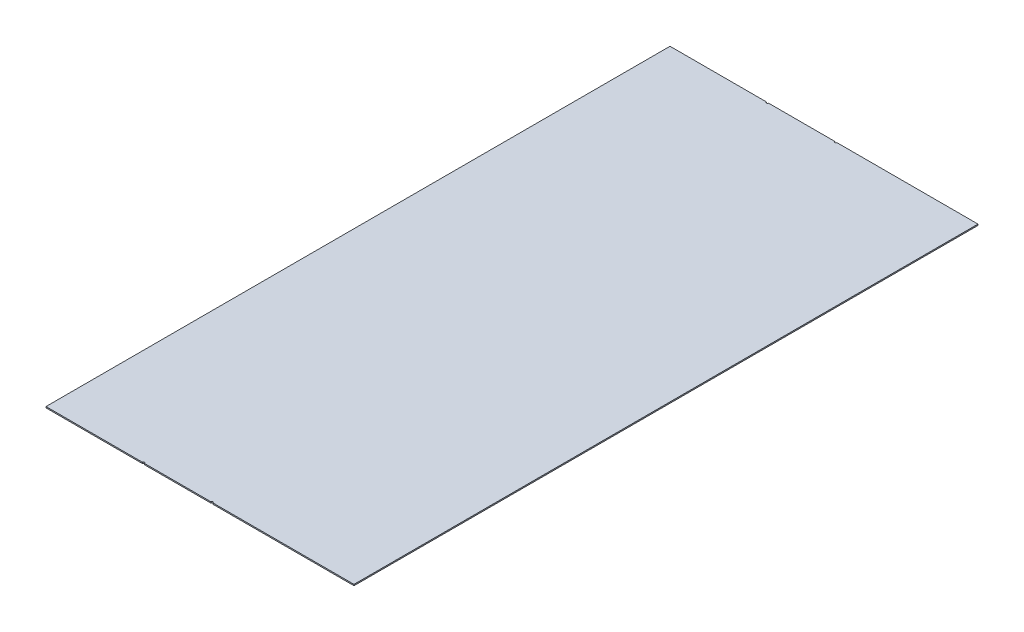
ISO-10303-21;
HEADER;
FILE_DESCRIPTION(('STEP AP214'),'2;1');
FILE_NAME('part.step','',(''),(''),'','','');
FILE_SCHEMA(('AUTOMOTIVE_DESIGN { 1 0 10303 214 1 1 1 1 }'));
ENDSEC;
DATA;
#1=APPLICATION_CONTEXT('core data for automotive mechanical design processes');
#2=APPLICATION_PROTOCOL_DEFINITION('international standard','automotive_design',2000,#1);
#3=PRODUCT_CONTEXT('',#1,'mechanical');
#4=PRODUCT('Part','Part','',(#3));
#5=PRODUCT_RELATED_PRODUCT_CATEGORY('part','',(#4));
#6=PRODUCT_DEFINITION_FORMATION('','',#4);
#7=PRODUCT_DEFINITION_CONTEXT('part definition',#1,'design');
#8=PRODUCT_DEFINITION('design','',#6,#7);
#9=PRODUCT_DEFINITION_SHAPE('','',#8);
#10=(LENGTH_UNIT() NAMED_UNIT(*) SI_UNIT(.MILLI.,.METRE.));
#11=(NAMED_UNIT(*) PLANE_ANGLE_UNIT() SI_UNIT($,.RADIAN.));
#12=(NAMED_UNIT(*) SI_UNIT($,.STERADIAN.) SOLID_ANGLE_UNIT());
#13=UNCERTAINTY_MEASURE_WITH_UNIT(LENGTH_MEASURE(1.E-05),#10,'distance_accuracy_value','');
#14=(GEOMETRIC_REPRESENTATION_CONTEXT(3) GLOBAL_UNCERTAINTY_ASSIGNED_CONTEXT((#13)) GLOBAL_UNIT_ASSIGNED_CONTEXT((#10,
#11,#12)) REPRESENTATION_CONTEXT('',''));
#15=CARTESIAN_POINT('',(0.,0.,0.));
#16=DIRECTION('',(0.,0.,1.));
#17=DIRECTION('',(1.,0.,0.));
#18=AXIS2_PLACEMENT_3D('',#15,#16,#17);
#19=CARTESIAN_POINT('',(-78.9587528010179,-593.535533905934,-2550.));
#20=DIRECTION('',(0.,0.,-1.));
#21=DIRECTION('',(-0.707106781186542,-0.707106781186553,0.));
#22=AXIS2_PLACEMENT_3D('',#19,#20,#21);
#23=PLANE('',#22);
#24=DIRECTION('',(0.,1.,0.));
#25=VECTOR('',#24,1.);
#26=CARTESIAN_POINT('',(-81.9266755409145,-600.000000000013,-2550.));
#27=LINE('',#26,#25);
#28=CARTESIAN_POINT('',(-81.9266755409145,-600.000000000013,-2550.));
#29=VERTEX_POINT('',#28);
#30=CARTESIAN_POINT('',(-81.9266755409145,-595.,-2550.));
#31=VERTEX_POINT('',#30);
#32=EDGE_CURVE('E66',#29,#31,#27,.T.);
#33=ORIENTED_EDGE('',*,*,#32,.F.);
#34=DIRECTION('',(1.,0.,0.));
#35=VECTOR('',#34,1.);
#36=CARTESIAN_POINT('',(-79.565354518816,-600.000000000002,-2550.));
#37=LINE('',#36,#35);
#38=CARTESIAN_POINT('',(-476.287996563013,-600.000000000013,-2550.));
#39=VERTEX_POINT('',#38);
#40=EDGE_CURVE('E155',#39,#29,#37,.T.);
#41=ORIENTED_EDGE('',*,*,#40,.F.);
#42=DIRECTION('',(0.,1.,0.));
#43=VECTOR('',#42,1.);
#44=CARTESIAN_POINT('',(-476.287996563013,-600.000000000013,-2550.));
#45=LINE('',#44,#43);
#46=CARTESIAN_POINT('',(-476.287996563013,-595.000000000013,-2550.));
#47=VERTEX_POINT('',#46);
#48=EDGE_CURVE('E190',#39,#47,#45,.T.);
#49=ORIENTED_EDGE('',*,*,#48,.T.);
#50=DIRECTION('',(1.,0.,0.));
#51=VECTOR('',#50,1.);
#52=CARTESIAN_POINT('',(-79.565354518816,-595.000000000001,-2550.));
#53=LINE('',#52,#51);
#54=EDGE_CURVE('E153',#47,#31,#53,.T.);
#55=ORIENTED_EDGE('',*,*,#54,.T.);
#56=EDGE_LOOP('',(#33,#41,#49,#55));
#57=FACE_BOUND('',#56,.T.);
#58=ADVANCED_FACE('F43',(#57),#23,.T.);
#59=DIRECTION('',(0.,1.,0.));
#60=VECTOR('',#59,1.);
#61=CARTESIAN_POINT('',(-73.9266755409145,-600.000000000013,-2550.));
#62=LINE('',#61,#60);
#63=CARTESIAN_POINT('',(-73.9266755409145,-595.,-2550.));
#64=VERTEX_POINT('',#63);
#65=CARTESIAN_POINT('',(-73.9266755409145,-600.000000000013,-2550.));
#66=VERTEX_POINT('',#65);
#67=EDGE_CURVE('E219',#64,#66,#62,.F.);
#68=ORIENTED_EDGE('',*,*,#67,.F.);
#69=CARTESIAN_POINT('',(197.638678977901,-595.,-2550.));
#70=VERTEX_POINT('',#69);
#71=EDGE_CURVE('E157',#64,#70,#53,.T.);
#72=ORIENTED_EDGE('',*,*,#71,.T.);
#73=DIRECTION('',(0.,1.,0.));
#74=VECTOR('',#73,1.);
#75=CARTESIAN_POINT('',(197.638678977901,-600.000000000013,-2550.));
#76=LINE('',#75,#74);
#77=CARTESIAN_POINT('',(197.638678977901,-600.000000000013,-2550.));
#78=VERTEX_POINT('',#77);
#79=EDGE_CURVE('E58',#78,#70,#76,.T.);
#80=ORIENTED_EDGE('',*,*,#79,.F.);
#81=EDGE_CURVE('E146',#66,#78,#37,.T.);
#82=ORIENTED_EDGE('',*,*,#81,.F.);
#83=EDGE_LOOP('',(#68,#72,#80,#82));
#84=FACE_BOUND('',#83,.T.);
#85=ADVANCED_FACE('F255',(#84),#23,.T.);
#86=CARTESIAN_POINT('',(202.670756238004,-593.535533905933,0.));
#87=DIRECTION('',(0.,0.,1.));
#88=DIRECTION('',(0.707106781186542,0.707106781186553,0.));
#89=AXIS2_PLACEMENT_3D('',#86,#87,#88);
#90=PLANE('',#89);
#91=DIRECTION('',(0.,1.,0.));
#92=VECTOR('',#91,1.);
#93=CARTESIAN_POINT('',(205.638678977901,-600.000000000013,0.));
#94=LINE('',#93,#92);
#95=CARTESIAN_POINT('',(205.638678977901,-600.000000000013,0.));
#96=VERTEX_POINT('',#95);
#97=CARTESIAN_POINT('',(205.638678977901,-595.,0.));
#98=VERTEX_POINT('',#97);
#99=EDGE_CURVE('E186',#96,#98,#94,.T.);
#100=ORIENTED_EDGE('',*,*,#99,.F.);
#101=DIRECTION('',(1.,0.,0.));
#102=VECTOR('',#101,1.);
#103=CARTESIAN_POINT('',(-79.565354518816,-600.000000000002,0.));
#104=LINE('',#103,#102);
#105=CARTESIAN_POINT('',(782.34,-600.,0.));
#106=VERTEX_POINT('',#105);
#107=EDGE_CURVE('E196',#96,#106,#104,.T.);
#108=ORIENTED_EDGE('',*,*,#107,.T.);
#109=DIRECTION('',(0.,-1.,0.));
#110=VECTOR('',#109,1.);
#111=CARTESIAN_POINT('',(782.34,-595.,0.));
#112=LINE('',#111,#110);
#113=CARTESIAN_POINT('',(782.34,-595.,0.));
#114=VERTEX_POINT('',#113);
#115=EDGE_CURVE('E189',#114,#106,#112,.T.);
#116=ORIENTED_EDGE('',*,*,#115,.F.);
#117=DIRECTION('',(1.,0.,0.));
#118=VECTOR('',#117,1.);
#119=CARTESIAN_POINT('',(-79.565354518816,-595.000000000001,0.));
#120=LINE('',#119,#118);
#121=EDGE_CURVE('E176',#98,#114,#120,.T.);
#122=ORIENTED_EDGE('',*,*,#121,.F.);
#123=EDGE_LOOP('',(#100,#108,#116,#122));
#124=FACE_BOUND('',#123,.T.);
#125=ADVANCED_FACE('F185',(#124),#90,.T.);
#126=DIRECTION('',(0.,1.,0.));
#127=VECTOR('',#126,1.);
#128=CARTESIAN_POINT('',(197.638678977901,-600.000000000013,0.));
#129=LINE('',#128,#127);
#130=CARTESIAN_POINT('',(197.638678977901,-595.,0.));
#131=VERTEX_POINT('',#130);
#132=CARTESIAN_POINT('',(197.638678977901,-600.000000000013,0.));
#133=VERTEX_POINT('',#132);
#134=EDGE_CURVE('E222',#131,#133,#129,.F.);
#135=ORIENTED_EDGE('',*,*,#134,.F.);
#136=CARTESIAN_POINT('',(-73.9266755409145,-595.,0.));
#137=VERTEX_POINT('',#136);
#138=EDGE_CURVE('E179',#137,#131,#120,.T.);
#139=ORIENTED_EDGE('',*,*,#138,.F.);
#140=DIRECTION('',(0.,1.,0.));
#141=VECTOR('',#140,1.);
#142=CARTESIAN_POINT('',(-73.9266755409145,-600.000000000013,0.));
#143=LINE('',#142,#141);
#144=CARTESIAN_POINT('',(-73.9266755409145,-600.000000000013,0.));
#145=VERTEX_POINT('',#144);
#146=EDGE_CURVE('E224',#145,#137,#143,.T.);
#147=ORIENTED_EDGE('',*,*,#146,.F.);
#148=EDGE_CURVE('E198',#145,#133,#104,.T.);
#149=ORIENTED_EDGE('',*,*,#148,.T.);
#150=EDGE_LOOP('',(#135,#139,#147,#149));
#151=FACE_BOUND('',#150,.T.);
#152=ADVANCED_FACE('F240',(#151),#90,.T.);
#153=DIRECTION('',(0.,1.,0.));
#154=VECTOR('',#153,1.);
#155=CARTESIAN_POINT('',(205.638678977901,-600.000000000013,-2550.));
#156=LINE('',#155,#154);
#157=CARTESIAN_POINT('',(205.638678977901,-595.,-2550.));
#158=VERTEX_POINT('',#157);
#159=CARTESIAN_POINT('',(205.638678977901,-600.000000000013,-2550.));
#160=VERTEX_POINT('',#159);
#161=EDGE_CURVE('E129',#158,#160,#156,.F.);
#162=ORIENTED_EDGE('',*,*,#161,.F.);
#163=CARTESIAN_POINT('',(782.34,-595.,-2550.));
#164=VERTEX_POINT('',#163);
#165=EDGE_CURVE('E159',#158,#164,#53,.T.);
#166=ORIENTED_EDGE('',*,*,#165,.T.);
#167=DIRECTION('',(0.,-1.,0.));
#168=VECTOR('',#167,1.);
#169=CARTESIAN_POINT('',(782.34,-595.,-2550.));
#170=LINE('',#169,#168);
#171=CARTESIAN_POINT('',(782.34,-600.,-2550.));
#172=VERTEX_POINT('',#171);
#173=EDGE_CURVE('E151',#164,#172,#170,.T.);
#174=ORIENTED_EDGE('',*,*,#173,.T.);
#175=EDGE_CURVE('E143',#160,#172,#37,.T.);
#176=ORIENTED_EDGE('',*,*,#175,.F.);
#177=EDGE_LOOP('',(#162,#166,#174,#176));
#178=FACE_BOUND('',#177,.T.);
#179=ADVANCED_FACE('F149',(#178),#23,.T.);
#180=DIRECTION('',(0.,1.,0.));
#181=VECTOR('',#180,1.);
#182=CARTESIAN_POINT('',(-81.9266755409145,-600.000000000013,0.));
#183=LINE('',#182,#181);
#184=CARTESIAN_POINT('',(-81.9266755409145,-595.,0.));
#185=VERTEX_POINT('',#184);
#186=CARTESIAN_POINT('',(-81.9266755409145,-600.000000000013,0.));
#187=VERTEX_POINT('',#186);
#188=EDGE_CURVE('E226',#185,#187,#183,.F.);
#189=ORIENTED_EDGE('',*,*,#188,.F.);
#190=CARTESIAN_POINT('',(-476.287996563013,-595.000000000013,0.));
#191=VERTEX_POINT('',#190);
#192=EDGE_CURVE('E191',#191,#185,#120,.T.);
#193=ORIENTED_EDGE('',*,*,#192,.F.);
#194=DIRECTION('',(0.,1.,0.));
#195=VECTOR('',#194,1.);
#196=CARTESIAN_POINT('',(-476.287996563013,-600.000000000013,0.));
#197=LINE('',#196,#195);
#198=CARTESIAN_POINT('',(-476.287996563013,-600.000000000013,0.));
#199=VERTEX_POINT('',#198);
#200=EDGE_CURVE('E205',#199,#191,#197,.T.);
#201=ORIENTED_EDGE('',*,*,#200,.F.);
#202=EDGE_CURVE('E171',#199,#187,#104,.T.);
#203=ORIENTED_EDGE('',*,*,#202,.T.);
#204=EDGE_LOOP('',(#189,#193,#201,#203));
#205=FACE_BOUND('',#204,.T.);
#206=ADVANCED_FACE('F263',(#205),#90,.T.);
#207=CARTESIAN_POINT('',(-79.565354518816,-600.000000000002,-2550.));
#208=DIRECTION('',(0.,-1.,0.));
#209=DIRECTION('',(1.,0.,0.));
#210=AXIS2_PLACEMENT_3D('',#207,#208,#209);
#211=PLANE('',#210);
#212=CARTESIAN_POINT('',(-77.9266755409145,-600.000000000013,-2550.));
#213=DIRECTION('',(0.,1.,0.));
#214=DIRECTION('',(0.,0.,1.));
#215=AXIS2_PLACEMENT_3D('',#212,#213,#214);
#216=CIRCLE('',#215,4.00000000000001);
#217=EDGE_CURVE('E147',#29,#66,#216,.T.);
#218=ORIENTED_EDGE('',*,*,#217,.T.);
#219=ORIENTED_EDGE('',*,*,#81,.T.);
#220=CARTESIAN_POINT('',(201.638678977901,-600.000000000013,-2550.));
#221=DIRECTION('',(0.,1.,0.));
#222=DIRECTION('',(0.,0.,1.));
#223=AXIS2_PLACEMENT_3D('',#220,#221,#222);
#224=CIRCLE('',#223,3.99999999999999);
#225=EDGE_CURVE('E132',#78,#160,#224,.T.);
#226=ORIENTED_EDGE('',*,*,#225,.T.);
#227=ORIENTED_EDGE('',*,*,#175,.T.);
#228=DIRECTION('',(0.,0.,1.));
#229=VECTOR('',#228,1.);
#230=CARTESIAN_POINT('',(782.34,-600.,-2550.));
#231=LINE('',#230,#229);
#232=EDGE_CURVE('E215',#172,#106,#231,.T.);
#233=ORIENTED_EDGE('',*,*,#232,.T.);
#234=ORIENTED_EDGE('',*,*,#107,.F.);
#235=CARTESIAN_POINT('',(201.638678977901,-600.000000000013,0.));
#236=DIRECTION('',(0.,1.,0.));
#237=DIRECTION('',(0.,0.,1.));
#238=AXIS2_PLACEMENT_3D('',#235,#236,#237);
#239=CIRCLE('',#238,3.99999999999999);
#240=EDGE_CURVE('E229',#96,#133,#239,.T.);
#241=ORIENTED_EDGE('',*,*,#240,.T.);
#242=ORIENTED_EDGE('',*,*,#148,.F.);
#243=CARTESIAN_POINT('',(-77.9266755409145,-600.000000000013,0.));
#244=DIRECTION('',(0.,1.,0.));
#245=DIRECTION('',(0.,0.,1.));
#246=AXIS2_PLACEMENT_3D('',#243,#244,#245);
#247=CIRCLE('',#246,4.00000000000001);
#248=EDGE_CURVE('E232',#145,#187,#247,.T.);
#249=ORIENTED_EDGE('',*,*,#248,.T.);
#250=ORIENTED_EDGE('',*,*,#202,.F.);
#251=DIRECTION('',(0.,0.,1.));
#252=VECTOR('',#251,1.);
#253=CARTESIAN_POINT('',(-476.287996563013,-600.000000000013,-2550.));
#254=LINE('',#253,#252);
#255=EDGE_CURVE('E208',#39,#199,#254,.T.);
#256=ORIENTED_EDGE('',*,*,#255,.F.);
#257=ORIENTED_EDGE('',*,*,#40,.T.);
#258=EDGE_LOOP('',(#218,#219,#226,#227,#233,#234,#241,#242,#249,#250,#256,#257));
#259=FACE_BOUND('',#258,.T.);
#260=ADVANCED_FACE('F141',(#259),#211,.T.);
#261=CARTESIAN_POINT('',(199.999999999999,-595.,-2550.));
#262=DIRECTION('',(0.,-1.,0.));
#263=DIRECTION('',(0.,0.,-1.));
#264=AXIS2_PLACEMENT_3D('',#261,#262,#263);
#265=PLANE('',#264);
#266=ORIENTED_EDGE('',*,*,#71,.F.);
#267=CARTESIAN_POINT('',(-77.9266755409145,-595.,-2550.));
#268=DIRECTION('',(0.,-1.,0.));
#269=DIRECTION('',(0.,0.,-1.));
#270=AXIS2_PLACEMENT_3D('',#267,#268,#269);
#271=CIRCLE('',#270,4.00000000000001);
#272=EDGE_CURVE('E12',#64,#31,#271,.T.);
#273=ORIENTED_EDGE('',*,*,#272,.T.);
#274=ORIENTED_EDGE('',*,*,#54,.F.);
#275=DIRECTION('',(0.,0.,1.));
#276=VECTOR('',#275,1.);
#277=CARTESIAN_POINT('',(-476.287996563013,-595.000000000013,-2550.));
#278=LINE('',#277,#276);
#279=EDGE_CURVE('E193',#47,#191,#278,.T.);
#280=ORIENTED_EDGE('',*,*,#279,.T.);
#281=ORIENTED_EDGE('',*,*,#192,.T.);
#282=CARTESIAN_POINT('',(-77.9266755409145,-595.,0.));
#283=DIRECTION('',(0.,-1.,0.));
#284=DIRECTION('',(0.,0.,-1.));
#285=AXIS2_PLACEMENT_3D('',#282,#283,#284);
#286=CIRCLE('',#285,4.00000000000001);
#287=EDGE_CURVE('E163',#185,#137,#286,.T.);
#288=ORIENTED_EDGE('',*,*,#287,.T.);
#289=ORIENTED_EDGE('',*,*,#138,.T.);
#290=CARTESIAN_POINT('',(201.638678977901,-595.,0.));
#291=DIRECTION('',(0.,-1.,0.));
#292=DIRECTION('',(0.,0.,-1.));
#293=AXIS2_PLACEMENT_3D('',#290,#291,#292);
#294=CIRCLE('',#293,3.99999999999999);
#295=EDGE_CURVE('E51',#131,#98,#294,.T.);
#296=ORIENTED_EDGE('',*,*,#295,.T.);
#297=ORIENTED_EDGE('',*,*,#121,.T.);
#298=DIRECTION('',(0.,0.,1.));
#299=VECTOR('',#298,1.);
#300=CARTESIAN_POINT('',(782.34,-595.,-2550.));
#301=LINE('',#300,#299);
#302=EDGE_CURVE('E213',#164,#114,#301,.T.);
#303=ORIENTED_EDGE('',*,*,#302,.F.);
#304=ORIENTED_EDGE('',*,*,#165,.F.);
#305=CARTESIAN_POINT('',(201.638678977901,-595.,-2550.));
#306=DIRECTION('',(0.,-1.,0.));
#307=DIRECTION('',(0.,0.,-1.));
#308=AXIS2_PLACEMENT_3D('',#305,#306,#307);
#309=CIRCLE('',#308,3.99999999999999);
#310=EDGE_CURVE('E133',#158,#70,#309,.T.);
#311=ORIENTED_EDGE('',*,*,#310,.T.);
#312=EDGE_LOOP('',(#266,#273,#274,#280,#281,#288,#289,#296,#297,#303,#304,#311));
#313=FACE_BOUND('',#312,.T.);
#314=ADVANCED_FACE('F45',(#313),#265,.F.);
#315=CARTESIAN_POINT('',(-476.287996563013,-600.000000000013,-2550.));
#316=DIRECTION('',(1.,0.,0.));
#317=DIRECTION('',(0.,1.,0.));
#318=AXIS2_PLACEMENT_3D('',#315,#316,#317);
#319=PLANE('',#318);
#320=ORIENTED_EDGE('',*,*,#200,.T.);
#321=ORIENTED_EDGE('',*,*,#279,.F.);
#322=ORIENTED_EDGE('',*,*,#48,.F.);
#323=ORIENTED_EDGE('',*,*,#255,.T.);
#324=EDGE_LOOP('',(#320,#321,#322,#323));
#325=FACE_BOUND('',#324,.T.);
#326=ADVANCED_FACE('F245',(#325),#319,.F.);
#327=CARTESIAN_POINT('',(782.34,-595.,-2550.));
#328=DIRECTION('',(-1.,0.,0.));
#329=DIRECTION('',(0.,-1.,0.));
#330=AXIS2_PLACEMENT_3D('',#327,#328,#329);
#331=PLANE('',#330);
#332=ORIENTED_EDGE('',*,*,#115,.T.);
#333=ORIENTED_EDGE('',*,*,#232,.F.);
#334=ORIENTED_EDGE('',*,*,#173,.F.);
#335=ORIENTED_EDGE('',*,*,#302,.T.);
#336=EDGE_LOOP('',(#332,#333,#334,#335));
#337=FACE_BOUND('',#336,.T.);
#338=ADVANCED_FACE('F243',(#337),#331,.F.);
#339=CARTESIAN_POINT('',(201.638678977901,-600.000000000013,-2550.));
#340=DIRECTION('',(0.,1.,0.));
#341=DIRECTION('',(0.,0.,1.));
#342=AXIS2_PLACEMENT_3D('',#339,#340,#341);
#343=CYLINDRICAL_SURFACE('',#342,3.99999999999999);
#344=ORIENTED_EDGE('',*,*,#79,.T.);
#345=ORIENTED_EDGE('',*,*,#310,.F.);
#346=ORIENTED_EDGE('',*,*,#161,.T.);
#347=ORIENTED_EDGE('',*,*,#225,.F.);
#348=EDGE_LOOP('',(#344,#345,#346,#347));
#349=FACE_BOUND('',#348,.T.);
#350=ADVANCED_FACE('F131',(#349),#343,.F.);
#351=CARTESIAN_POINT('',(-77.9266755409145,-600.000000000013,0.));
#352=DIRECTION('',(0.,1.,0.));
#353=DIRECTION('',(0.,0.,1.));
#354=AXIS2_PLACEMENT_3D('',#351,#352,#353);
#355=CYLINDRICAL_SURFACE('',#354,4.00000000000001);
#356=ORIENTED_EDGE('',*,*,#146,.T.);
#357=ORIENTED_EDGE('',*,*,#287,.F.);
#358=ORIENTED_EDGE('',*,*,#188,.T.);
#359=ORIENTED_EDGE('',*,*,#248,.F.);
#360=EDGE_LOOP('',(#356,#357,#358,#359));
#361=FACE_BOUND('',#360,.T.);
#362=ADVANCED_FACE('F238',(#361),#355,.F.);
#363=CARTESIAN_POINT('',(201.638678977901,-600.000000000013,0.));
#364=DIRECTION('',(0.,1.,0.));
#365=DIRECTION('',(0.,0.,1.));
#366=AXIS2_PLACEMENT_3D('',#363,#364,#365);
#367=CYLINDRICAL_SURFACE('',#366,3.99999999999999);
#368=ORIENTED_EDGE('',*,*,#99,.T.);
#369=ORIENTED_EDGE('',*,*,#295,.F.);
#370=ORIENTED_EDGE('',*,*,#134,.T.);
#371=ORIENTED_EDGE('',*,*,#240,.F.);
#372=EDGE_LOOP('',(#368,#369,#370,#371));
#373=FACE_BOUND('',#372,.T.);
#374=ADVANCED_FACE('F241',(#373),#367,.F.);
#375=CARTESIAN_POINT('',(-77.9266755409145,-600.000000000013,-2550.));
#376=DIRECTION('',(0.,1.,0.));
#377=DIRECTION('',(0.,0.,1.));
#378=AXIS2_PLACEMENT_3D('',#375,#376,#377);
#379=CYLINDRICAL_SURFACE('',#378,4.00000000000001);
#380=ORIENTED_EDGE('',*,*,#32,.T.);
#381=ORIENTED_EDGE('',*,*,#272,.F.);
#382=ORIENTED_EDGE('',*,*,#67,.T.);
#383=ORIENTED_EDGE('',*,*,#217,.F.);
#384=EDGE_LOOP('',(#380,#381,#382,#383));
#385=FACE_BOUND('',#384,.T.);
#386=ADVANCED_FACE('F446',(#385),#379,.F.);
#387=CLOSED_SHELL('',(#58,#85,#125,#152,#179,#206,#260,#314,#326,#338,#350,#362,#374,#386));
#388=MANIFOLD_SOLID_BREP('B2',#387);
#389=ADVANCED_BREP_SHAPE_REPRESENTATION('',(#18,#388),#14);
#390=SHAPE_DEFINITION_REPRESENTATION(#9,#389);
ENDSEC;
END-ISO-10303-21;
